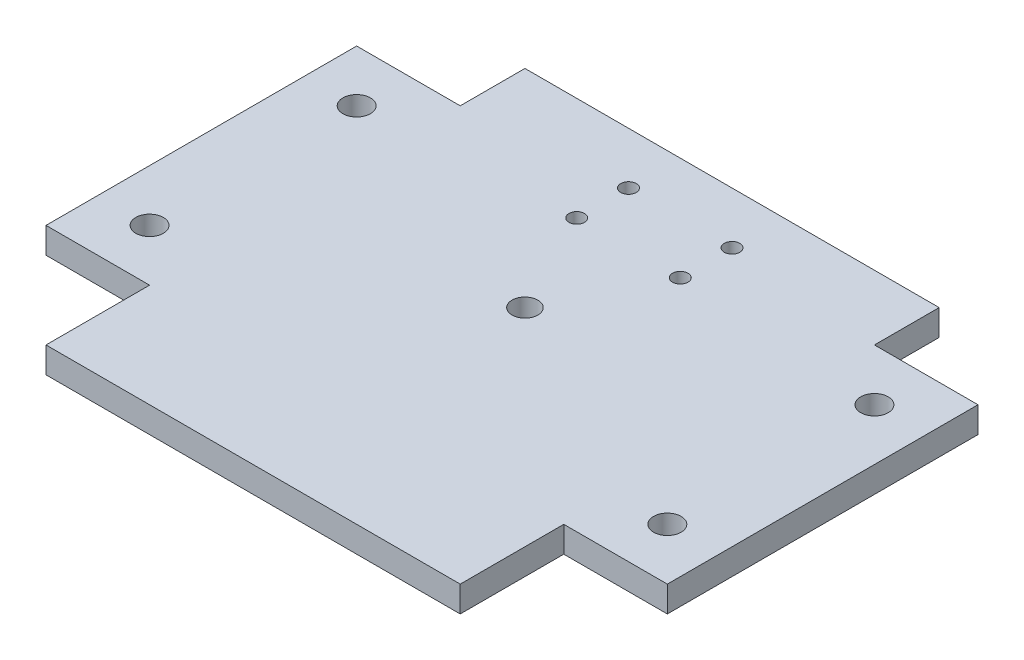
ISO-10303-21;
HEADER;
FILE_DESCRIPTION(('STEP AP214'),'2;1');
FILE_NAME('part.step','',(''),(''),'','','');
FILE_SCHEMA(('AUTOMOTIVE_DESIGN { 1 0 10303 214 1 1 1 1 }'));
ENDSEC;
DATA;
#1=APPLICATION_CONTEXT('core data for automotive mechanical design processes');
#2=APPLICATION_PROTOCOL_DEFINITION('international standard','automotive_design',2000,#1);
#3=PRODUCT_CONTEXT('',#1,'mechanical');
#4=PRODUCT('Part','Part','',(#3));
#5=PRODUCT_RELATED_PRODUCT_CATEGORY('part','',(#4));
#6=PRODUCT_DEFINITION_FORMATION('','',#4);
#7=PRODUCT_DEFINITION_CONTEXT('part definition',#1,'design');
#8=PRODUCT_DEFINITION('design','',#6,#7);
#9=PRODUCT_DEFINITION_SHAPE('','',#8);
#10=(LENGTH_UNIT() NAMED_UNIT(*) SI_UNIT(.MILLI.,.METRE.));
#11=(NAMED_UNIT(*) PLANE_ANGLE_UNIT() SI_UNIT($,.RADIAN.));
#12=(NAMED_UNIT(*) SI_UNIT($,.STERADIAN.) SOLID_ANGLE_UNIT());
#13=UNCERTAINTY_MEASURE_WITH_UNIT(LENGTH_MEASURE(1.E-05),#10,'distance_accuracy_value','');
#14=(GEOMETRIC_REPRESENTATION_CONTEXT(3) GLOBAL_UNCERTAINTY_ASSIGNED_CONTEXT((#13)) GLOBAL_UNIT_ASSIGNED_CONTEXT((#10,
#11,#12)) REPRESENTATION_CONTEXT('',''));
#15=CARTESIAN_POINT('',(0.,0.,0.));
#16=DIRECTION('',(0.,0.,1.));
#17=DIRECTION('',(1.,0.,0.));
#18=AXIS2_PLACEMENT_3D('',#15,#16,#17);
#19=CARTESIAN_POINT('',(0.,6.35,0.));
#20=DIRECTION('',(0.,0.,-1.));
#21=DIRECTION('',(-1.,0.,0.));
#22=AXIS2_PLACEMENT_3D('',#19,#20,#21);
#23=PLANE('',#22);
#24=DIRECTION('',(1.,0.,0.));
#25=VECTOR('',#24,1.);
#26=CARTESIAN_POINT('',(0.,0.,0.));
#27=LINE('',#26,#25);
#28=CARTESIAN_POINT('',(25.4,0.,0.));
#29=VERTEX_POINT('',#28);
#30=CARTESIAN_POINT('',(127.,0.,0.));
#31=VERTEX_POINT('',#30);
#32=EDGE_CURVE('E210',#29,#31,#27,.T.);
#33=ORIENTED_EDGE('',*,*,#32,.T.);
#34=DIRECTION('',(0.,-1.,0.));
#35=VECTOR('',#34,1.);
#36=CARTESIAN_POINT('',(127.,6.35,0.));
#37=LINE('',#36,#35);
#38=CARTESIAN_POINT('',(127.,6.35,0.));
#39=VERTEX_POINT('',#38);
#40=EDGE_CURVE('E11',#39,#31,#37,.T.);
#41=ORIENTED_EDGE('',*,*,#40,.F.);
#42=DIRECTION('',(1.,0.,0.));
#43=VECTOR('',#42,1.);
#44=CARTESIAN_POINT('',(0.,6.35,0.));
#45=LINE('',#44,#43);
#46=CARTESIAN_POINT('',(25.4,6.35,0.));
#47=VERTEX_POINT('',#46);
#48=EDGE_CURVE('E643',#47,#39,#45,.T.);
#49=ORIENTED_EDGE('',*,*,#48,.F.);
#50=DIRECTION('',(0.,-1.,0.));
#51=VECTOR('',#50,1.);
#52=CARTESIAN_POINT('',(25.4,6.35,0.));
#53=LINE('',#52,#51);
#54=EDGE_CURVE('E63',#47,#29,#53,.T.);
#55=ORIENTED_EDGE('',*,*,#54,.T.);
#56=EDGE_LOOP('',(#33,#41,#49,#55));
#57=FACE_BOUND('',#56,.T.);
#58=ADVANCED_FACE('F45',(#57),#23,.F.);
#59=CARTESIAN_POINT('',(127.,6.35,1.38777878078145E-13));
#60=DIRECTION('',(-1.,0.,0.));
#61=DIRECTION('',(0.,0.,1.));
#62=AXIS2_PLACEMENT_3D('',#59,#60,#61);
#63=PLANE('',#62);
#64=DIRECTION('',(0.,0.,-1.));
#65=VECTOR('',#64,1.);
#66=CARTESIAN_POINT('',(127.,0.,1.38777878078145E-13));
#67=LINE('',#66,#65);
#68=CARTESIAN_POINT('',(127.,0.,-25.4));
#69=VERTEX_POINT('',#68);
#70=EDGE_CURVE('E213',#31,#69,#67,.T.);
#71=ORIENTED_EDGE('',*,*,#70,.T.);
#72=DIRECTION('',(0.,-1.,0.));
#73=VECTOR('',#72,1.);
#74=CARTESIAN_POINT('',(127.,6.35,-25.4));
#75=LINE('',#74,#73);
#76=CARTESIAN_POINT('',(127.,6.35,-25.4));
#77=VERTEX_POINT('',#76);
#78=EDGE_CURVE('E55',#77,#69,#75,.T.);
#79=ORIENTED_EDGE('',*,*,#78,.F.);
#80=DIRECTION('',(0.,0.,-1.));
#81=VECTOR('',#80,1.);
#82=CARTESIAN_POINT('',(127.,6.35,1.38777878078145E-13));
#83=LINE('',#82,#81);
#84=EDGE_CURVE('E114',#39,#77,#83,.T.);
#85=ORIENTED_EDGE('',*,*,#84,.F.);
#86=ORIENTED_EDGE('',*,*,#40,.T.);
#87=EDGE_LOOP('',(#71,#79,#85,#86));
#88=FACE_BOUND('',#87,.T.);
#89=ADVANCED_FACE('F285',(#88),#63,.F.);
#90=CARTESIAN_POINT('',(0.,6.35,-25.4));
#91=DIRECTION('',(0.,0.,1.));
#92=DIRECTION('',(1.,0.,0.));
#93=AXIS2_PLACEMENT_3D('',#90,#91,#92);
#94=PLANE('',#93);
#95=DIRECTION('',(-1.,0.,0.));
#96=VECTOR('',#95,1.);
#97=CARTESIAN_POINT('',(0.,0.,-25.4));
#98=LINE('',#97,#96);
#99=CARTESIAN_POINT('',(152.4,0.,-25.4));
#100=VERTEX_POINT('',#99);
#101=EDGE_CURVE('E217',#100,#69,#98,.T.);
#102=ORIENTED_EDGE('',*,*,#101,.F.);
#103=DIRECTION('',(0.,-1.,0.));
#104=VECTOR('',#103,1.);
#105=CARTESIAN_POINT('',(152.4,6.35,-25.4));
#106=LINE('',#105,#104);
#107=CARTESIAN_POINT('',(152.4,6.35,-25.4));
#108=VERTEX_POINT('',#107);
#109=EDGE_CURVE('E276',#108,#100,#106,.T.);
#110=ORIENTED_EDGE('',*,*,#109,.F.);
#111=DIRECTION('',(-1.,0.,0.));
#112=VECTOR('',#111,1.);
#113=CARTESIAN_POINT('',(0.,6.35,-25.4));
#114=LINE('',#113,#112);
#115=EDGE_CURVE('E284',#108,#77,#114,.T.);
#116=ORIENTED_EDGE('',*,*,#115,.T.);
#117=ORIENTED_EDGE('',*,*,#78,.T.);
#118=EDGE_LOOP('',(#102,#110,#116,#117));
#119=FACE_BOUND('',#118,.T.);
#120=ADVANCED_FACE('F282',(#119),#94,.T.);
#121=CARTESIAN_POINT('',(152.4,6.35,0.));
#122=DIRECTION('',(-1.,0.,0.));
#123=DIRECTION('',(0.,0.,1.));
#124=AXIS2_PLACEMENT_3D('',#121,#122,#123);
#125=PLANE('',#124);
#126=DIRECTION('',(0.,0.,-1.));
#127=VECTOR('',#126,1.);
#128=CARTESIAN_POINT('',(152.4,0.,0.));
#129=LINE('',#128,#127);
#130=CARTESIAN_POINT('',(152.4,0.,-101.6));
#131=VERTEX_POINT('',#130);
#132=EDGE_CURVE('E221',#100,#131,#129,.T.);
#133=ORIENTED_EDGE('',*,*,#132,.T.);
#134=DIRECTION('',(0.,-1.,0.));
#135=VECTOR('',#134,1.);
#136=CARTESIAN_POINT('',(152.4,6.35,-101.6));
#137=LINE('',#136,#135);
#138=CARTESIAN_POINT('',(152.4,6.35,-101.6));
#139=VERTEX_POINT('',#138);
#140=EDGE_CURVE('E272',#139,#131,#137,.T.);
#141=ORIENTED_EDGE('',*,*,#140,.F.);
#142=DIRECTION('',(0.,0.,-1.));
#143=VECTOR('',#142,1.);
#144=CARTESIAN_POINT('',(152.4,6.35,0.));
#145=LINE('',#144,#143);
#146=EDGE_CURVE('E304',#108,#139,#145,.T.);
#147=ORIENTED_EDGE('',*,*,#146,.F.);
#148=ORIENTED_EDGE('',*,*,#109,.T.);
#149=EDGE_LOOP('',(#133,#141,#147,#148));
#150=FACE_BOUND('',#149,.T.);
#151=ADVANCED_FACE('F293',(#150),#125,.F.);
#152=CARTESIAN_POINT('',(0.,6.35,-101.6));
#153=DIRECTION('',(0.,0.,1.));
#154=DIRECTION('',(1.,0.,0.));
#155=AXIS2_PLACEMENT_3D('',#152,#153,#154);
#156=PLANE('',#155);
#157=DIRECTION('',(-1.,0.,0.));
#158=VECTOR('',#157,1.);
#159=CARTESIAN_POINT('',(0.,0.,-101.6));
#160=LINE('',#159,#158);
#161=CARTESIAN_POINT('',(127.,0.,-101.6));
#162=VERTEX_POINT('',#161);
#163=EDGE_CURVE('E224',#131,#162,#160,.T.);
#164=ORIENTED_EDGE('',*,*,#163,.T.);
#165=DIRECTION('',(0.,-1.,0.));
#166=VECTOR('',#165,1.);
#167=CARTESIAN_POINT('',(127.,6.35,-101.6));
#168=LINE('',#167,#166);
#169=CARTESIAN_POINT('',(127.,6.35,-101.6));
#170=VERTEX_POINT('',#169);
#171=EDGE_CURVE('E269',#170,#162,#168,.T.);
#172=ORIENTED_EDGE('',*,*,#171,.F.);
#173=DIRECTION('',(-1.,0.,0.));
#174=VECTOR('',#173,1.);
#175=CARTESIAN_POINT('',(0.,6.35,-101.6));
#176=LINE('',#175,#174);
#177=EDGE_CURVE('E299',#139,#170,#176,.T.);
#178=ORIENTED_EDGE('',*,*,#177,.F.);
#179=ORIENTED_EDGE('',*,*,#140,.T.);
#180=EDGE_LOOP('',(#164,#172,#178,#179));
#181=FACE_BOUND('',#180,.T.);
#182=ADVANCED_FACE('F297',(#181),#156,.F.);
#183=CARTESIAN_POINT('',(127.,6.35,-2.22044604925032E-13));
#184=DIRECTION('',(1.,0.,0.));
#185=DIRECTION('',(0.,0.,-1.));
#186=AXIS2_PLACEMENT_3D('',#183,#184,#185);
#187=PLANE('',#186);
#188=DIRECTION('',(0.,0.,1.));
#189=VECTOR('',#188,1.);
#190=CARTESIAN_POINT('',(127.,0.,-2.22044604925032E-13));
#191=LINE('',#190,#189);
#192=CARTESIAN_POINT('',(127.,0.,-117.475));
#193=VERTEX_POINT('',#192);
#194=EDGE_CURVE('E228',#193,#162,#191,.T.);
#195=ORIENTED_EDGE('',*,*,#194,.F.);
#196=DIRECTION('',(0.,-1.,0.));
#197=VECTOR('',#196,1.);
#198=CARTESIAN_POINT('',(127.,6.35,-117.475));
#199=LINE('',#198,#197);
#200=CARTESIAN_POINT('',(127.,6.35,-117.475));
#201=VERTEX_POINT('',#200);
#202=EDGE_CURVE('E266',#201,#193,#199,.T.);
#203=ORIENTED_EDGE('',*,*,#202,.F.);
#204=DIRECTION('',(0.,0.,1.));
#205=VECTOR('',#204,1.);
#206=CARTESIAN_POINT('',(127.,6.35,-2.22044604925032E-13));
#207=LINE('',#206,#205);
#208=EDGE_CURVE('E303',#201,#170,#207,.T.);
#209=ORIENTED_EDGE('',*,*,#208,.T.);
#210=ORIENTED_EDGE('',*,*,#171,.T.);
#211=EDGE_LOOP('',(#195,#203,#209,#210));
#212=FACE_BOUND('',#211,.T.);
#213=ADVANCED_FACE('F526',(#212),#187,.T.);
#214=CARTESIAN_POINT('',(0.,6.35,-117.475));
#215=DIRECTION('',(0.,0.,-1.));
#216=DIRECTION('',(-1.,0.,0.));
#217=AXIS2_PLACEMENT_3D('',#214,#215,#216);
#218=PLANE('',#217);
#219=DIRECTION('',(1.,0.,0.));
#220=VECTOR('',#219,1.);
#221=CARTESIAN_POINT('',(0.,0.,-117.475));
#222=LINE('',#221,#220);
#223=CARTESIAN_POINT('',(25.4,0.,-117.475));
#224=VERTEX_POINT('',#223);
#225=EDGE_CURVE('E232',#224,#193,#222,.T.);
#226=ORIENTED_EDGE('',*,*,#225,.F.);
#227=DIRECTION('',(0.,-1.,0.));
#228=VECTOR('',#227,1.);
#229=CARTESIAN_POINT('',(25.4,6.35,-117.475));
#230=LINE('',#229,#228);
#231=CARTESIAN_POINT('',(25.4,6.35,-117.475));
#232=VERTEX_POINT('',#231);
#233=EDGE_CURVE('E263',#232,#224,#230,.T.);
#234=ORIENTED_EDGE('',*,*,#233,.F.);
#235=DIRECTION('',(1.,0.,0.));
#236=VECTOR('',#235,1.);
#237=CARTESIAN_POINT('',(0.,6.35,-117.475));
#238=LINE('',#237,#236);
#239=EDGE_CURVE('E308',#232,#201,#238,.T.);
#240=ORIENTED_EDGE('',*,*,#239,.T.);
#241=ORIENTED_EDGE('',*,*,#202,.T.);
#242=EDGE_LOOP('',(#226,#234,#240,#241));
#243=FACE_BOUND('',#242,.T.);
#244=ADVANCED_FACE('F516',(#243),#218,.T.);
#245=CARTESIAN_POINT('',(25.4,6.35,0.));
#246=DIRECTION('',(1.,0.,0.));
#247=DIRECTION('',(0.,0.,-1.));
#248=AXIS2_PLACEMENT_3D('',#245,#246,#247);
#249=PLANE('',#248);
#250=DIRECTION('',(0.,0.,1.));
#251=VECTOR('',#250,1.);
#252=CARTESIAN_POINT('',(25.4,0.,0.));
#253=LINE('',#252,#251);
#254=CARTESIAN_POINT('',(25.4,0.,-101.6));
#255=VERTEX_POINT('',#254);
#256=EDGE_CURVE('E236',#224,#255,#253,.T.);
#257=ORIENTED_EDGE('',*,*,#256,.T.);
#258=DIRECTION('',(0.,-1.,0.));
#259=VECTOR('',#258,1.);
#260=CARTESIAN_POINT('',(25.4,6.35,-101.6));
#261=LINE('',#260,#259);
#262=CARTESIAN_POINT('',(25.4,6.35,-101.6));
#263=VERTEX_POINT('',#262);
#264=EDGE_CURVE('E260',#263,#255,#261,.T.);
#265=ORIENTED_EDGE('',*,*,#264,.F.);
#266=DIRECTION('',(0.,0.,1.));
#267=VECTOR('',#266,1.);
#268=CARTESIAN_POINT('',(25.4,6.35,0.));
#269=LINE('',#268,#267);
#270=EDGE_CURVE('E168',#232,#263,#269,.T.);
#271=ORIENTED_EDGE('',*,*,#270,.F.);
#272=ORIENTED_EDGE('',*,*,#233,.T.);
#273=EDGE_LOOP('',(#257,#265,#271,#272));
#274=FACE_BOUND('',#273,.T.);
#275=ADVANCED_FACE('F320',(#274),#249,.F.);
#276=CARTESIAN_POINT('',(0.,6.35,-101.6));
#277=DIRECTION('',(0.,0.,-1.));
#278=DIRECTION('',(-1.,0.,0.));
#279=AXIS2_PLACEMENT_3D('',#276,#277,#278);
#280=PLANE('',#279);
#281=DIRECTION('',(1.,0.,0.));
#282=VECTOR('',#281,1.);
#283=CARTESIAN_POINT('',(0.,0.,-101.6));
#284=LINE('',#283,#282);
#285=CARTESIAN_POINT('',(0.,0.,-101.6));
#286=VERTEX_POINT('',#285);
#287=EDGE_CURVE('E240',#286,#255,#284,.T.);
#288=ORIENTED_EDGE('',*,*,#287,.F.);
#289=DIRECTION('',(0.,-1.,0.));
#290=VECTOR('',#289,1.);
#291=CARTESIAN_POINT('',(0.,6.35,-101.6));
#292=LINE('',#291,#290);
#293=CARTESIAN_POINT('',(0.,6.35,-101.6));
#294=VERTEX_POINT('',#293);
#295=EDGE_CURVE('E152',#294,#286,#292,.T.);
#296=ORIENTED_EDGE('',*,*,#295,.F.);
#297=DIRECTION('',(1.,0.,0.));
#298=VECTOR('',#297,1.);
#299=CARTESIAN_POINT('',(0.,6.35,-101.6));
#300=LINE('',#299,#298);
#301=EDGE_CURVE('E164',#294,#263,#300,.T.);
#302=ORIENTED_EDGE('',*,*,#301,.T.);
#303=ORIENTED_EDGE('',*,*,#264,.T.);
#304=EDGE_LOOP('',(#288,#296,#302,#303));
#305=FACE_BOUND('',#304,.T.);
#306=ADVANCED_FACE('F324',(#305),#280,.T.);
#307=CARTESIAN_POINT('',(0.,6.35,0.));
#308=DIRECTION('',(-1.,0.,0.));
#309=DIRECTION('',(0.,0.,1.));
#310=AXIS2_PLACEMENT_3D('',#307,#308,#309);
#311=PLANE('',#310);
#312=DIRECTION('',(0.,0.,-1.));
#313=VECTOR('',#312,1.);
#314=CARTESIAN_POINT('',(0.,0.,0.));
#315=LINE('',#314,#313);
#316=CARTESIAN_POINT('',(0.,0.,-25.4));
#317=VERTEX_POINT('',#316);
#318=EDGE_CURVE('E148',#317,#286,#315,.T.);
#319=ORIENTED_EDGE('',*,*,#318,.F.);
#320=DIRECTION('',(0.,-1.,0.));
#321=VECTOR('',#320,1.);
#322=CARTESIAN_POINT('',(0.,6.35,-25.4));
#323=LINE('',#322,#321);
#324=CARTESIAN_POINT('',(0.,6.35,-25.4));
#325=VERTEX_POINT('',#324);
#326=EDGE_CURVE('E142',#325,#317,#323,.T.);
#327=ORIENTED_EDGE('',*,*,#326,.F.);
#328=DIRECTION('',(0.,0.,-1.));
#329=VECTOR('',#328,1.);
#330=CARTESIAN_POINT('',(0.,6.35,0.));
#331=LINE('',#330,#329);
#332=EDGE_CURVE('E146',#325,#294,#331,.T.);
#333=ORIENTED_EDGE('',*,*,#332,.T.);
#334=ORIENTED_EDGE('',*,*,#295,.T.);
#335=EDGE_LOOP('',(#319,#327,#333,#334));
#336=FACE_BOUND('',#335,.T.);
#337=ADVANCED_FACE('F144',(#336),#311,.T.);
#338=CARTESIAN_POINT('',(0.,6.35,-25.4));
#339=DIRECTION('',(0.,0.,-1.));
#340=DIRECTION('',(-1.,0.,0.));
#341=AXIS2_PLACEMENT_3D('',#338,#339,#340);
#342=PLANE('',#341);
#343=DIRECTION('',(1.,0.,0.));
#344=VECTOR('',#343,1.);
#345=CARTESIAN_POINT('',(0.,0.,-25.4));
#346=LINE('',#345,#344);
#347=CARTESIAN_POINT('',(25.4,0.,-25.4));
#348=VERTEX_POINT('',#347);
#349=EDGE_CURVE('E246',#317,#348,#346,.T.);
#350=ORIENTED_EDGE('',*,*,#349,.T.);
#351=DIRECTION('',(0.,-1.,0.));
#352=VECTOR('',#351,1.);
#353=CARTESIAN_POINT('',(25.4,6.35,-25.4));
#354=LINE('',#353,#352);
#355=CARTESIAN_POINT('',(25.4,6.35,-25.4));
#356=VERTEX_POINT('',#355);
#357=EDGE_CURVE('E102',#356,#348,#354,.T.);
#358=ORIENTED_EDGE('',*,*,#357,.F.);
#359=DIRECTION('',(1.,0.,0.));
#360=VECTOR('',#359,1.);
#361=CARTESIAN_POINT('',(0.,6.35,-25.4));
#362=LINE('',#361,#360);
#363=EDGE_CURVE('E154',#325,#356,#362,.T.);
#364=ORIENTED_EDGE('',*,*,#363,.F.);
#365=ORIENTED_EDGE('',*,*,#326,.T.);
#366=EDGE_LOOP('',(#350,#358,#364,#365));
#367=FACE_BOUND('',#366,.T.);
#368=ADVANCED_FACE('F155',(#367),#342,.F.);
#369=CARTESIAN_POINT('',(12.7,6.35,-88.9));
#370=DIRECTION('',(0.,-1.,0.));
#371=DIRECTION('',(0.,0.,-1.));
#372=AXIS2_PLACEMENT_3D('',#369,#370,#371);
#373=CYLINDRICAL_SURFACE('',#372,3.37819999999999);
#374=CARTESIAN_POINT('',(12.7,6.35,-88.9));
#375=DIRECTION('',(0.,1.,0.));
#376=DIRECTION('',(0.,0.,1.));
#377=AXIS2_PLACEMENT_3D('',#374,#375,#376);
#378=CIRCLE('',#377,3.37819999999999);
#379=CARTESIAN_POINT('',(12.7,6.35,-85.5218));
#380=VERTEX_POINT('',#379);
#381=EDGE_CURVE('E639',#380,#380,#378,.T.);
#382=ORIENTED_EDGE('',*,*,#381,.T.);
#383=EDGE_LOOP('',(#382));
#384=FACE_BOUND('',#383,.T.);
#385=CARTESIAN_POINT('',(12.7,0.,-88.9));
#386=DIRECTION('',(0.,1.,0.));
#387=DIRECTION('',(0.,0.,1.));
#388=AXIS2_PLACEMENT_3D('',#385,#386,#387);
#389=CIRCLE('',#388,3.37819999999999);
#390=CARTESIAN_POINT('',(12.7,0.,-85.5218));
#391=VERTEX_POINT('',#390);
#392=EDGE_CURVE('E206',#391,#391,#389,.T.);
#393=ORIENTED_EDGE('',*,*,#392,.F.);
#394=EDGE_LOOP('',(#393));
#395=FACE_BOUND('',#394,.T.);
#396=ADVANCED_FACE('F346',(#384,#395),#373,.F.);
#397=CARTESIAN_POINT('',(139.7,6.35,-88.9));
#398=DIRECTION('',(0.,-1.,0.));
#399=DIRECTION('',(0.,0.,-1.));
#400=AXIS2_PLACEMENT_3D('',#397,#398,#399);
#401=CYLINDRICAL_SURFACE('',#400,3.37819999999999);
#402=CARTESIAN_POINT('',(139.7,6.35,-88.9));
#403=DIRECTION('',(0.,1.,0.));
#404=DIRECTION('',(0.,0.,1.));
#405=AXIS2_PLACEMENT_3D('',#402,#403,#404);
#406=CIRCLE('',#405,3.37819999999999);
#407=CARTESIAN_POINT('',(139.7,6.35,-85.5218));
#408=VERTEX_POINT('',#407);
#409=EDGE_CURVE('E635',#408,#408,#406,.T.);
#410=ORIENTED_EDGE('',*,*,#409,.T.);
#411=EDGE_LOOP('',(#410));
#412=FACE_BOUND('',#411,.T.);
#413=CARTESIAN_POINT('',(139.7,0.,-88.9));
#414=DIRECTION('',(0.,1.,0.));
#415=DIRECTION('',(0.,0.,1.));
#416=AXIS2_PLACEMENT_3D('',#413,#414,#415);
#417=CIRCLE('',#416,3.37819999999999);
#418=CARTESIAN_POINT('',(139.7,0.,-85.5218));
#419=VERTEX_POINT('',#418);
#420=EDGE_CURVE('E202',#419,#419,#417,.T.);
#421=ORIENTED_EDGE('',*,*,#420,.F.);
#422=EDGE_LOOP('',(#421));
#423=FACE_BOUND('',#422,.T.);
#424=ADVANCED_FACE('F349',(#412,#423),#401,.F.);
#425=CARTESIAN_POINT('',(12.7,6.35,-38.1));
#426=DIRECTION('',(0.,-1.,0.));
#427=DIRECTION('',(0.,0.,-1.));
#428=AXIS2_PLACEMENT_3D('',#425,#426,#427);
#429=CYLINDRICAL_SURFACE('',#428,3.3782);
#430=CARTESIAN_POINT('',(12.7,6.35,-38.1));
#431=DIRECTION('',(0.,1.,0.));
#432=DIRECTION('',(0.,0.,1.));
#433=AXIS2_PLACEMENT_3D('',#430,#431,#432);
#434=CIRCLE('',#433,3.3782);
#435=CARTESIAN_POINT('',(12.7,6.35,-34.7218));
#436=VERTEX_POINT('',#435);
#437=EDGE_CURVE('E631',#436,#436,#434,.T.);
#438=ORIENTED_EDGE('',*,*,#437,.T.);
#439=EDGE_LOOP('',(#438));
#440=FACE_BOUND('',#439,.T.);
#441=CARTESIAN_POINT('',(12.7,0.,-38.1));
#442=DIRECTION('',(0.,1.,0.));
#443=DIRECTION('',(0.,0.,1.));
#444=AXIS2_PLACEMENT_3D('',#441,#442,#443);
#445=CIRCLE('',#444,3.3782);
#446=CARTESIAN_POINT('',(12.7,0.,-34.7218));
#447=VERTEX_POINT('',#446);
#448=EDGE_CURVE('E198',#447,#447,#445,.T.);
#449=ORIENTED_EDGE('',*,*,#448,.F.);
#450=EDGE_LOOP('',(#449));
#451=FACE_BOUND('',#450,.T.);
#452=ADVANCED_FACE('F353',(#440,#451),#429,.F.);
#453=CARTESIAN_POINT('',(139.7,6.35,-38.1));
#454=DIRECTION('',(0.,-1.,0.));
#455=DIRECTION('',(0.,0.,-1.));
#456=AXIS2_PLACEMENT_3D('',#453,#454,#455);
#457=CYLINDRICAL_SURFACE('',#456,3.37819999999999);
#458=CARTESIAN_POINT('',(139.7,6.35,-38.1));
#459=DIRECTION('',(0.,1.,0.));
#460=DIRECTION('',(0.,0.,1.));
#461=AXIS2_PLACEMENT_3D('',#458,#459,#460);
#462=CIRCLE('',#461,3.37819999999999);
#463=CARTESIAN_POINT('',(139.7,6.35,-34.7218));
#464=VERTEX_POINT('',#463);
#465=EDGE_CURVE('E627',#464,#464,#462,.T.);
#466=ORIENTED_EDGE('',*,*,#465,.T.);
#467=EDGE_LOOP('',(#466));
#468=FACE_BOUND('',#467,.T.);
#469=CARTESIAN_POINT('',(139.7,0.,-38.1));
#470=DIRECTION('',(0.,1.,0.));
#471=DIRECTION('',(0.,0.,1.));
#472=AXIS2_PLACEMENT_3D('',#469,#470,#471);
#473=CIRCLE('',#472,3.37819999999999);
#474=CARTESIAN_POINT('',(139.7,0.,-34.7218));
#475=VERTEX_POINT('',#474);
#476=EDGE_CURVE('E194',#475,#475,#473,.T.);
#477=ORIENTED_EDGE('',*,*,#476,.F.);
#478=EDGE_LOOP('',(#477));
#479=FACE_BOUND('',#478,.T.);
#480=ADVANCED_FACE('F357',(#468,#479),#457,.F.);
#481=CARTESIAN_POINT('',(63.5,6.35,-104.775));
#482=DIRECTION('',(0.,-1.,0.));
#483=DIRECTION('',(0.,0.,-1.));
#484=AXIS2_PLACEMENT_3D('',#481,#482,#483);
#485=CYLINDRICAL_SURFACE('',#484,1.90500000000001);
#486=CARTESIAN_POINT('',(63.5,6.35,-104.775));
#487=DIRECTION('',(0.,1.,0.));
#488=DIRECTION('',(0.,0.,1.));
#489=AXIS2_PLACEMENT_3D('',#486,#487,#488);
#490=CIRCLE('',#489,1.90500000000001);
#491=CARTESIAN_POINT('',(63.5,6.35,-102.87));
#492=VERTEX_POINT('',#491);
#493=EDGE_CURVE('E623',#492,#492,#490,.T.);
#494=ORIENTED_EDGE('',*,*,#493,.T.);
#495=EDGE_LOOP('',(#494));
#496=FACE_BOUND('',#495,.T.);
#497=CARTESIAN_POINT('',(63.5,0.,-104.775));
#498=DIRECTION('',(0.,1.,0.));
#499=DIRECTION('',(0.,0.,1.));
#500=AXIS2_PLACEMENT_3D('',#497,#498,#499);
#501=CIRCLE('',#500,1.90500000000001);
#502=CARTESIAN_POINT('',(63.5,0.,-102.87));
#503=VERTEX_POINT('',#502);
#504=EDGE_CURVE('E190',#503,#503,#501,.T.);
#505=ORIENTED_EDGE('',*,*,#504,.F.);
#506=EDGE_LOOP('',(#505));
#507=FACE_BOUND('',#506,.T.);
#508=ADVANCED_FACE('F361',(#496,#507),#485,.F.);
#509=CARTESIAN_POINT('',(88.9,6.35,-104.775));
#510=DIRECTION('',(0.,-1.,0.));
#511=DIRECTION('',(0.,0.,-1.));
#512=AXIS2_PLACEMENT_3D('',#509,#510,#511);
#513=CYLINDRICAL_SURFACE('',#512,1.90500000000001);
#514=CARTESIAN_POINT('',(88.9,6.35,-104.775));
#515=DIRECTION('',(0.,1.,0.));
#516=DIRECTION('',(0.,0.,1.));
#517=AXIS2_PLACEMENT_3D('',#514,#515,#516);
#518=CIRCLE('',#517,1.90500000000001);
#519=CARTESIAN_POINT('',(88.9,6.35,-102.87));
#520=VERTEX_POINT('',#519);
#521=EDGE_CURVE('E615',#520,#520,#518,.T.);
#522=ORIENTED_EDGE('',*,*,#521,.T.);
#523=EDGE_LOOP('',(#522));
#524=FACE_BOUND('',#523,.T.);
#525=CARTESIAN_POINT('',(88.9,0.,-104.775));
#526=DIRECTION('',(0.,1.,0.));
#527=DIRECTION('',(0.,0.,1.));
#528=AXIS2_PLACEMENT_3D('',#525,#526,#527);
#529=CIRCLE('',#528,1.90500000000001);
#530=CARTESIAN_POINT('',(88.9,0.,-102.87));
#531=VERTEX_POINT('',#530);
#532=EDGE_CURVE('E186',#531,#531,#529,.T.);
#533=ORIENTED_EDGE('',*,*,#532,.F.);
#534=EDGE_LOOP('',(#533));
#535=FACE_BOUND('',#534,.T.);
#536=ADVANCED_FACE('F365',(#524,#535),#513,.F.);
#537=CARTESIAN_POINT('',(63.5,6.35,-92.075));
#538=DIRECTION('',(0.,-1.,0.));
#539=DIRECTION('',(0.,0.,-1.));
#540=AXIS2_PLACEMENT_3D('',#537,#538,#539);
#541=CYLINDRICAL_SURFACE('',#540,1.90500000000001);
#542=CARTESIAN_POINT('',(63.5,6.35,-92.075));
#543=DIRECTION('',(0.,1.,0.));
#544=DIRECTION('',(0.,0.,1.));
#545=AXIS2_PLACEMENT_3D('',#542,#543,#544);
#546=CIRCLE('',#545,1.90500000000001);
#547=CARTESIAN_POINT('',(63.5,6.35,-90.17));
#548=VERTEX_POINT('',#547);
#549=EDGE_CURVE('E610',#548,#548,#546,.T.);
#550=ORIENTED_EDGE('',*,*,#549,.T.);
#551=EDGE_LOOP('',(#550));
#552=FACE_BOUND('',#551,.T.);
#553=CARTESIAN_POINT('',(63.5,0.,-92.075));
#554=DIRECTION('',(0.,1.,0.));
#555=DIRECTION('',(0.,0.,1.));
#556=AXIS2_PLACEMENT_3D('',#553,#554,#555);
#557=CIRCLE('',#556,1.90500000000001);
#558=CARTESIAN_POINT('',(63.5,0.,-90.17));
#559=VERTEX_POINT('',#558);
#560=EDGE_CURVE('E182',#559,#559,#557,.T.);
#561=ORIENTED_EDGE('',*,*,#560,.F.);
#562=EDGE_LOOP('',(#561));
#563=FACE_BOUND('',#562,.T.);
#564=ADVANCED_FACE('F369',(#552,#563),#541,.F.);
#565=CARTESIAN_POINT('',(88.9,6.35,-92.075));
#566=DIRECTION('',(0.,-1.,0.));
#567=DIRECTION('',(0.,0.,-1.));
#568=AXIS2_PLACEMENT_3D('',#565,#566,#567);
#569=CYLINDRICAL_SURFACE('',#568,1.90500000000001);
#570=CARTESIAN_POINT('',(88.9,6.35,-92.075));
#571=DIRECTION('',(0.,1.,0.));
#572=DIRECTION('',(0.,0.,1.));
#573=AXIS2_PLACEMENT_3D('',#570,#571,#572);
#574=CIRCLE('',#573,1.90500000000001);
#575=CARTESIAN_POINT('',(88.9,6.35,-90.17));
#576=VERTEX_POINT('',#575);
#577=EDGE_CURVE('E380',#576,#576,#574,.T.);
#578=ORIENTED_EDGE('',*,*,#577,.T.);
#579=EDGE_LOOP('',(#578));
#580=FACE_BOUND('',#579,.T.);
#581=CARTESIAN_POINT('',(88.9,0.,-92.075));
#582=DIRECTION('',(0.,1.,0.));
#583=DIRECTION('',(0.,0.,1.));
#584=AXIS2_PLACEMENT_3D('',#581,#582,#583);
#585=CIRCLE('',#584,1.90500000000001);
#586=CARTESIAN_POINT('',(88.9,0.,-90.17));
#587=VERTEX_POINT('',#586);
#588=EDGE_CURVE('E178',#587,#587,#585,.T.);
#589=ORIENTED_EDGE('',*,*,#588,.F.);
#590=EDGE_LOOP('',(#589));
#591=FACE_BOUND('',#590,.T.);
#592=ADVANCED_FACE('F334',(#580,#591),#569,.F.);
#593=CARTESIAN_POINT('',(76.2,6.35,-66.675));
#594=DIRECTION('',(0.,-1.,0.));
#595=DIRECTION('',(0.,0.,-1.));
#596=AXIS2_PLACEMENT_3D('',#593,#594,#595);
#597=CYLINDRICAL_SURFACE('',#596,3.175);
#598=CARTESIAN_POINT('',(76.2,6.35,-66.675));
#599=DIRECTION('',(0.,1.,0.));
#600=DIRECTION('',(0.,0.,1.));
#601=AXIS2_PLACEMENT_3D('',#598,#599,#600);
#602=CIRCLE('',#601,3.175);
#603=CARTESIAN_POINT('',(76.2,6.35,-63.5));
#604=VERTEX_POINT('',#603);
#605=EDGE_CURVE('E253',#604,#604,#602,.T.);
#606=ORIENTED_EDGE('',*,*,#605,.T.);
#607=EDGE_LOOP('',(#606));
#608=FACE_BOUND('',#607,.T.);
#609=CARTESIAN_POINT('',(76.2,0.,-66.675));
#610=DIRECTION('',(0.,1.,0.));
#611=DIRECTION('',(0.,0.,1.));
#612=AXIS2_PLACEMENT_3D('',#609,#610,#611);
#613=CIRCLE('',#612,3.175);
#614=CARTESIAN_POINT('',(76.2,0.,-63.5));
#615=VERTEX_POINT('',#614);
#616=EDGE_CURVE('E174',#615,#615,#613,.T.);
#617=ORIENTED_EDGE('',*,*,#616,.F.);
#618=EDGE_LOOP('',(#617));
#619=FACE_BOUND('',#618,.T.);
#620=ADVANCED_FACE('F47',(#608,#619),#597,.F.);
#621=CARTESIAN_POINT('',(25.4,6.35,0.));
#622=DIRECTION('',(-1.,0.,0.));
#623=DIRECTION('',(0.,0.,1.));
#624=AXIS2_PLACEMENT_3D('',#621,#622,#623);
#625=PLANE('',#624);
#626=DIRECTION('',(0.,0.,-1.));
#627=VECTOR('',#626,1.);
#628=CARTESIAN_POINT('',(25.4,0.,0.));
#629=LINE('',#628,#627);
#630=EDGE_CURVE('E249',#29,#348,#629,.T.);
#631=ORIENTED_EDGE('',*,*,#630,.F.);
#632=ORIENTED_EDGE('',*,*,#54,.F.);
#633=DIRECTION('',(0.,0.,-1.));
#634=VECTOR('',#633,1.);
#635=CARTESIAN_POINT('',(25.4,6.35,0.));
#636=LINE('',#635,#634);
#637=EDGE_CURVE('E159',#47,#356,#636,.T.);
#638=ORIENTED_EDGE('',*,*,#637,.T.);
#639=ORIENTED_EDGE('',*,*,#357,.T.);
#640=EDGE_LOOP('',(#631,#632,#638,#639));
#641=FACE_BOUND('',#640,.T.);
#642=ADVANCED_FACE('F325',(#641),#625,.T.);
#643=CARTESIAN_POINT('',(0.,6.35,0.));
#644=DIRECTION('',(0.,1.,0.));
#645=DIRECTION('',(0.,0.,1.));
#646=AXIS2_PLACEMENT_3D('',#643,#644,#645);
#647=PLANE('',#646);
#648=ORIENTED_EDGE('',*,*,#605,.F.);
#649=EDGE_LOOP('',(#648));
#650=FACE_BOUND('',#649,.T.);
#651=ORIENTED_EDGE('',*,*,#577,.F.);
#652=EDGE_LOOP('',(#651));
#653=FACE_BOUND('',#652,.T.);
#654=ORIENTED_EDGE('',*,*,#549,.F.);
#655=EDGE_LOOP('',(#654));
#656=FACE_BOUND('',#655,.T.);
#657=ORIENTED_EDGE('',*,*,#521,.F.);
#658=EDGE_LOOP('',(#657));
#659=FACE_BOUND('',#658,.T.);
#660=ORIENTED_EDGE('',*,*,#493,.F.);
#661=EDGE_LOOP('',(#660));
#662=FACE_BOUND('',#661,.T.);
#663=ORIENTED_EDGE('',*,*,#465,.F.);
#664=EDGE_LOOP('',(#663));
#665=FACE_BOUND('',#664,.T.);
#666=ORIENTED_EDGE('',*,*,#437,.F.);
#667=EDGE_LOOP('',(#666));
#668=FACE_BOUND('',#667,.T.);
#669=ORIENTED_EDGE('',*,*,#409,.F.);
#670=EDGE_LOOP('',(#669));
#671=FACE_BOUND('',#670,.T.);
#672=ORIENTED_EDGE('',*,*,#381,.F.);
#673=EDGE_LOOP('',(#672));
#674=FACE_BOUND('',#673,.T.);
#675=ORIENTED_EDGE('',*,*,#48,.T.);
#676=ORIENTED_EDGE('',*,*,#84,.T.);
#677=ORIENTED_EDGE('',*,*,#115,.F.);
#678=ORIENTED_EDGE('',*,*,#146,.T.);
#679=ORIENTED_EDGE('',*,*,#177,.T.);
#680=ORIENTED_EDGE('',*,*,#208,.F.);
#681=ORIENTED_EDGE('',*,*,#239,.F.);
#682=ORIENTED_EDGE('',*,*,#270,.T.);
#683=ORIENTED_EDGE('',*,*,#301,.F.);
#684=ORIENTED_EDGE('',*,*,#332,.F.);
#685=ORIENTED_EDGE('',*,*,#363,.T.);
#686=ORIENTED_EDGE('',*,*,#637,.F.);
#687=EDGE_LOOP('',(#675,#676,#677,#678,#679,#680,#681,#682,#683,#684,#685,#686));
#688=FACE_BOUND('',#687,.T.);
#689=ADVANCED_FACE('F162',(#650,#653,#656,#659,#662,#665,#668,#671,#674,#688),#647,.T.);
#690=CARTESIAN_POINT('',(0.,0.,0.));
#691=DIRECTION('',(0.,1.,0.));
#692=DIRECTION('',(0.,0.,1.));
#693=AXIS2_PLACEMENT_3D('',#690,#691,#692);
#694=PLANE('',#693);
#695=ORIENTED_EDGE('',*,*,#616,.T.);
#696=EDGE_LOOP('',(#695));
#697=FACE_BOUND('',#696,.T.);
#698=ORIENTED_EDGE('',*,*,#588,.T.);
#699=EDGE_LOOP('',(#698));
#700=FACE_BOUND('',#699,.T.);
#701=ORIENTED_EDGE('',*,*,#560,.T.);
#702=EDGE_LOOP('',(#701));
#703=FACE_BOUND('',#702,.T.);
#704=ORIENTED_EDGE('',*,*,#532,.T.);
#705=EDGE_LOOP('',(#704));
#706=FACE_BOUND('',#705,.T.);
#707=ORIENTED_EDGE('',*,*,#504,.T.);
#708=EDGE_LOOP('',(#707));
#709=FACE_BOUND('',#708,.T.);
#710=ORIENTED_EDGE('',*,*,#476,.T.);
#711=EDGE_LOOP('',(#710));
#712=FACE_BOUND('',#711,.T.);
#713=ORIENTED_EDGE('',*,*,#448,.T.);
#714=EDGE_LOOP('',(#713));
#715=FACE_BOUND('',#714,.T.);
#716=ORIENTED_EDGE('',*,*,#420,.T.);
#717=EDGE_LOOP('',(#716));
#718=FACE_BOUND('',#717,.T.);
#719=ORIENTED_EDGE('',*,*,#392,.T.);
#720=EDGE_LOOP('',(#719));
#721=FACE_BOUND('',#720,.T.);
#722=ORIENTED_EDGE('',*,*,#32,.F.);
#723=ORIENTED_EDGE('',*,*,#630,.T.);
#724=ORIENTED_EDGE('',*,*,#349,.F.);
#725=ORIENTED_EDGE('',*,*,#318,.T.);
#726=ORIENTED_EDGE('',*,*,#287,.T.);
#727=ORIENTED_EDGE('',*,*,#256,.F.);
#728=ORIENTED_EDGE('',*,*,#225,.T.);
#729=ORIENTED_EDGE('',*,*,#194,.T.);
#730=ORIENTED_EDGE('',*,*,#163,.F.);
#731=ORIENTED_EDGE('',*,*,#132,.F.);
#732=ORIENTED_EDGE('',*,*,#101,.T.);
#733=ORIENTED_EDGE('',*,*,#70,.F.);
#734=EDGE_LOOP('',(#722,#723,#724,#725,#726,#727,#728,#729,#730,#731,#732,#733));
#735=FACE_BOUND('',#734,.T.);
#736=ADVANCED_FACE('F289',(#697,#700,#703,#706,#709,#712,#715,#718,#721,#735),#694,.F.);
#737=CLOSED_SHELL('',(#58,#89,#120,#151,#182,#213,#244,#275,#306,#337,#368,#396,#424,#452,#480,
#508,#536,#564,#592,#620,#642,#689,#736));
#738=MANIFOLD_SOLID_BREP('B2',#737);
#739=ADVANCED_BREP_SHAPE_REPRESENTATION('',(#18,#738),#14);
#740=SHAPE_DEFINITION_REPRESENTATION(#9,#739);
ENDSEC;
END-ISO-10303-21;
